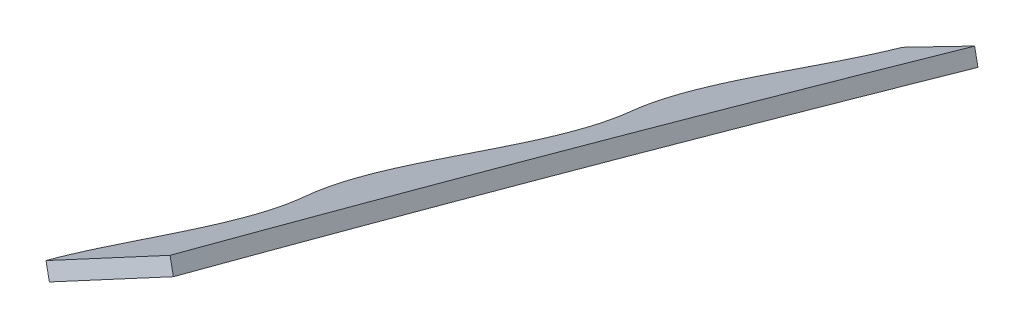
ISO-10303-21;
HEADER;
FILE_DESCRIPTION(('STEP AP214'),'2;1');
FILE_NAME('part.step','',(''),(''),'','','');
FILE_SCHEMA(('AUTOMOTIVE_DESIGN { 1 0 10303 214 1 1 1 1 }'));
ENDSEC;
DATA;
#1=APPLICATION_CONTEXT('core data for automotive mechanical design processes');
#2=APPLICATION_PROTOCOL_DEFINITION('international standard','automotive_design',2000,#1);
#3=PRODUCT_CONTEXT('',#1,'mechanical');
#4=PRODUCT('Part','Part','',(#3));
#5=PRODUCT_RELATED_PRODUCT_CATEGORY('part','',(#4));
#6=PRODUCT_DEFINITION_FORMATION('','',#4);
#7=PRODUCT_DEFINITION_CONTEXT('part definition',#1,'design');
#8=PRODUCT_DEFINITION('design','',#6,#7);
#9=PRODUCT_DEFINITION_SHAPE('','',#8);
#10=(LENGTH_UNIT() NAMED_UNIT(*) SI_UNIT(.MILLI.,.METRE.));
#11=(NAMED_UNIT(*) PLANE_ANGLE_UNIT() SI_UNIT($,.RADIAN.));
#12=(NAMED_UNIT(*) SI_UNIT($,.STERADIAN.) SOLID_ANGLE_UNIT());
#13=UNCERTAINTY_MEASURE_WITH_UNIT(LENGTH_MEASURE(1.E-05),#10,'distance_accuracy_value','');
#14=(GEOMETRIC_REPRESENTATION_CONTEXT(3) GLOBAL_UNCERTAINTY_ASSIGNED_CONTEXT((#13)) GLOBAL_UNIT_ASSIGNED_CONTEXT((#10,
#11,#12)) REPRESENTATION_CONTEXT('',''));
#15=CARTESIAN_POINT('',(0.,0.,0.));
#16=DIRECTION('',(0.,0.,1.));
#17=DIRECTION('',(1.,0.,0.));
#18=AXIS2_PLACEMENT_3D('',#15,#16,#17);
#19=CARTESIAN_POINT('',(-227.216189616129,83.2506448416713,499.552220094288));
#20=DIRECTION('',(-0.445503262094181,0.866025403784441,-0.226995249869768));
#21=DIRECTION('',(0.895192484018144,0.434454822827191,-0.0993952890212628));
#22=AXIS2_PLACEMENT_3D('',#19,#20,#21);
#23=PLANE('',#22);
#24=CARTESIAN_POINT('',(-172.274848039134,-88.2454839224226,-262.563071551798));
#25=CARTESIAN_POINT('',(-172.439831267016,-87.9227909712934,-261.008145359665));
#26=CARTESIAN_POINT('',(-172.678193137253,-87.6388750121653,-259.457146278866));
#27=CARTESIAN_POINT('',(-173.191359809754,-87.2352321682004,-256.910034020532));
#28=CARTESIAN_POINT('',(-173.423681819983,-87.0929392199138,-255.911204654988));
#29=CARTESIAN_POINT('',(-173.941160738584,-86.8421131443134,-253.938651044461));
#30=CARTESIAN_POINT('',(-174.226826981409,-86.7330860021534,-252.962042423846));
#31=CARTESIAN_POINT('',(-175.156975533093,-86.4505188180834,-250.058481340229));
#32=CARTESIAN_POINT('',(-175.87493206562,-86.3216904276833,-248.157910132924));
#33=CARTESIAN_POINT('',(-177.457786989215,-86.1534529403896,-244.40952786397));
#34=CARTESIAN_POINT('',(-178.322613076559,-86.1139998441347,-242.561690841339));
#35=CARTESIAN_POINT('',(-180.140834151136,-86.0889909449713,-238.897817864236));
#36=CARTESIAN_POINT('',(-181.094239221605,-86.1033646810172,-237.081493299449));
#37=CARTESIAN_POINT('',(-183.023234879632,-86.1464324091518,-233.459936848201));
#38=CARTESIAN_POINT('',(-183.998986310508,-86.1750375750492,-231.654050401957));
#39=CARTESIAN_POINT('',(-186.863052794487,-86.2211484455113,-226.208924228764));
#40=CARTESIAN_POINT('',(-188.685373763346,-86.1971861743637,-222.540997819584));
#41=CARTESIAN_POINT('',(-190.924486485076,-85.8506017338599,-216.824213206229));
#42=CARTESIAN_POINT('',(-191.589028343075,-85.6836555687967,-214.88304842063));
#43=CARTESIAN_POINT('',(-192.285870855619,-85.3908765572889,-212.398416365603));
#44=CARTESIAN_POINT('',(-192.418748654995,-85.3280090636639,-211.897778842578));
#45=CARTESIAN_POINT('',(-192.668624175468,-85.1945294250588,-210.898123045647));
#46=CARTESIAN_POINT('',(-192.785847828449,-85.123844932821,-210.398385338385));
#47=CARTESIAN_POINT('',(-193.114191540953,-84.899862874531,-208.899444952298));
#48=CARTESIAN_POINT('',(-193.30194773462,-84.7346180012592,-207.900515437317));
#49=CARTESIAN_POINT('',(-193.771813950714,-84.1911213049337,-204.904818926934));
#50=CARTESIAN_POINT('',(-193.960185118495,-83.764935338542,-202.909147900238));
#51=CARTESIAN_POINT('',(-194.064058276873,-83.03428504667,-199.917730479237));
#52=CARTESIAN_POINT('',(-194.068999796638,-82.7755563686706,-198.920938382749));
#53=CARTESIAN_POINT('',(-194.033602635075,-82.3655723876837,-197.426250754137));
#54=CARTESIAN_POINT('',(-194.01467181003,-82.2252641701454,-196.928104927292));
#55=CARTESIAN_POINT('',(-193.962862535708,-81.9375155013571,-195.931976345358));
#56=CARTESIAN_POINT('',(-193.929915849075,-81.7898775019719,-195.433373833957));
#57=CARTESIAN_POINT('',(-193.732653401734,-81.0394192007136,-192.957397398705));
#58=CARTESIAN_POINT('',(-193.470879681609,-80.396792013461,-191.019425466124));
#59=CARTESIAN_POINT('',(-192.780502657605,-79.0437225735269,-187.21217711051));
#60=CARTESIAN_POINT('',(-192.35181751995,-78.3332470559846,-185.342934384217));
#61=CARTESIAN_POINT('',(-190.862138665294,-76.1190489905928,-179.81905234203));
#62=CARTESIAN_POINT('',(-189.60002053076,-74.5335707659178,-176.247230138271));
#63=CARTESIAN_POINT('',(-188.152743373769,-72.8728266864691,-172.751650967128));
#64=B_SPLINE_CURVE_WITH_KNOTS('',3,(#24,#25,#26,#27,#28,#29,#30,#31,#32,#33,#34,#35,#36,#37,#38,
#39,#40,#41,#42,#43,#44,#45,#46,#47,#48,#49,#50,#51,#52,#53,#54,#55,#56,#57,#58,#59,#60,#61,#62,
#63),.UNSPECIFIED.,.F.,.F.,(4,2,2,2,2,2,2,2,2,2,2,2,2,2,2,2,2,2,2,4),(0.,0.0483442702171738,
0.0795942702171737,0.110844270217174,0.173344270217174,0.235844270217173,0.298344270217173,
0.360844270217173,0.485844270217173,0.548344270217173,0.563969270217173,0.579594270217173,
0.610844270217173,0.673344270217173,0.704594270217173,0.720219270217173,0.735844270217174,
0.798344270217174,0.860844270217174,0.985844270217174),.UNSPECIFIED.);
#65=CARTESIAN_POINT('',(-188.152743373769,-72.872826686469,-172.751650967128));
#66=VERTEX_POINT('',#65);
#67=CARTESIAN_POINT('',(-172.274848039781,-88.2454839227551,-262.563071551798));
#68=VERTEX_POINT('',#67);
#69=EDGE_CURVE('E63',#66,#68,#64,.F.);
#70=ORIENTED_EDGE('',*,*,#69,.T.);
#71=DIRECTION('',(0.889488775164077,0.456950848957748,-0.00237497240046185));
#72=VECTOR('',#71,1.);
#73=CARTESIAN_POINT('',(-147.648824523097,-75.5945290522712,-262.628824069218));
#74=LINE('',#73,#72);
#75=CARTESIAN_POINT('',(-144.201526122531,-73.8235725492409,-262.638028500782));
#76=VERTEX_POINT('',#75);
#77=EDGE_CURVE('E56',#68,#76,#74,.T.);
#78=ORIENTED_EDGE('',*,*,#77,.T.);
#79=CARTESIAN_POINT('',(-16.9046491299026,65.2692204150697,18.1903953203248));
#80=DIRECTION('',(0.445503262094181,-0.866025403784441,0.226995249869768));
#81=DIRECTION('',(0.0125403357558737,-0.247485367087003,-0.968810473238673));
#82=AXIS2_PLACEMENT_3D('',#79,#80,#81);
#83=ELLIPSE('',#82,713.671321725642,162.);
#84=CARTESIAN_POINT('',(-161.908015732658,-5.45842848385961,32.9375415344721));
#85=VERTEX_POINT('',#84);
#86=EDGE_CURVE('E114',#85,#76,#83,.T.);
#87=ORIENTED_EDGE('',*,*,#86,.F.);
#88=DIRECTION('',(-0.895192484018144,-0.434454822827191,0.0993952890212628));
#89=VECTOR('',#88,1.);
#90=CARTESIAN_POINT('',(-221.261607168342,-34.2639139092991,39.5277078735809));
#91=LINE('',#90,#89);
#92=CARTESIAN_POINT('',(-205.375560012895,-26.5540973887618,37.7638433677781));
#93=VERTEX_POINT('',#92);
#94=EDGE_CURVE('E176',#85,#93,#91,.T.);
#95=ORIENTED_EDGE('',*,*,#94,.T.);
#96=CARTESIAN_POINT('',(-205.20029301773,-27.6046990690454,33.4116388038746));
#97=CARTESIAN_POINT('',(-205.32125225234,-27.2880072514378,34.8572677014228));
#98=CARTESIAN_POINT('',(-205.379654706957,-26.9377960407233,36.3080041789655));
#99=CARTESIAN_POINT('',(-205.375560012895,-26.5540973887618,37.7638433677781));
#100=B_SPLINE_CURVE_WITH_KNOTS('',3,(#96,#97,#98,#99),.UNSPECIFIED.,.F.,.F.,(4,4),(0.,
0.0465437655749937),.UNSPECIFIED.);
#101=CARTESIAN_POINT('',(-205.200320367493,-27.6047129416401,33.4116395545035));
#102=VERTEX_POINT('',#101);
#103=EDGE_CURVE('E254',#93,#102,#100,.F.);
#104=ORIENTED_EDGE('',*,*,#103,.T.);
#105=CARTESIAN_POINT('',(-190.734375132116,-31.1238615505722,-8.40552574790049));
#106=CARTESIAN_POINT('',(-191.225622990637,-30.9066511376412,-6.61270294977395));
#107=CARTESIAN_POINT('',(-191.796402656058,-30.7371869636366,-4.84595019687956));
#108=CARTESIAN_POINT('',(-193.055664840276,-30.4689205152964,-1.35102697447093));
#109=CARTESIAN_POINT('',(-193.744068379148,-30.3700708260398,0.377169384185305));
#110=CARTESIAN_POINT('',(-195.910563886591,-30.1343272747744,5.52855788558893));
#111=CARTESIAN_POINT('',(-197.490234729324,-30.0584154196475,8.91845308781303));
#112=CARTESIAN_POINT('',(-199.724102363284,-29.8631181473629,14.0477574136626));
#113=CARTESIAN_POINT('',(-200.44585020281,-29.7842864233443,15.7650237122564));
#114=CARTESIAN_POINT('',(-201.453910991316,-29.6212767972674,18.3653637953677));
#115=CARTESIAN_POINT('',(-201.777543457747,-29.5595033477964,19.2362044678018));
#116=CARTESIAN_POINT('',(-202.393937467392,-29.4174233545711,20.9880051145696));
#117=CARTESIAN_POINT('',(-202.68685951747,-29.3370068809551,21.8696995024388));
#118=CARTESIAN_POINT('',(-203.506023134402,-29.0649076428021,24.5155033968704));
#119=CARTESIAN_POINT('',(-203.973922297989,-28.8417561324266,26.2851680961004));
#120=CARTESIAN_POINT('',(-204.726824659675,-28.2978149061482,29.8380502764758));
#121=CARTESIAN_POINT('',(-205.011950457218,-27.977090639419,31.6212586728743));
#122=CARTESIAN_POINT('',(-205.200293018085,-27.6046990681162,33.411638808115));
#123=B_SPLINE_CURVE_WITH_KNOTS('',3,(#105,#106,#107,#108,#109,#110,#111,#112,#113,#114,#115,
#116,#117,#118,#119,#120,#121,#122),.UNSPECIFIED.,.F.,.F.,(4,2,2,2,2,2,2,2,4),(0.,
0.124999999999998,0.249999999999996,0.499999999999996,0.624999999999996,0.687499999999996,
0.749999999999995,0.874999999999998,1.),.UNSPECIFIED.);
#124=CARTESIAN_POINT('',(-190.734413653469,-31.1238838328777,-8.40553515626446));
#125=VERTEX_POINT('',#124);
#126=EDGE_CURVE('E116',#125,#102,#123,.T.);
#127=ORIENTED_EDGE('',*,*,#126,.F.);
#128=CARTESIAN_POINT('',(-194.917793217108,-44.9118654147233,-52.7986803008964));
#129=CARTESIAN_POINT('',(-193.434700514925,-43.2514696172647,-49.3747218499109));
#130=CARTESIAN_POINT('',(-192.118155072448,-41.6566744340345,-45.8741734743483));
#131=CARTESIAN_POINT('',(-190.505014830945,-39.4069414864574,-40.4570264405086));
#132=CARTESIAN_POINT('',(-190.028134982414,-38.6809919864359,-38.6233352906957));
#133=CARTESIAN_POINT('',(-189.42491286372,-37.6362214197215,-35.8212483279959));
#134=CARTESIAN_POINT('',(-189.242580001583,-37.295346449345,-34.8786008535911));
#135=CARTESIAN_POINT('',(-188.919667300953,-36.6300424351216,-32.9741049828491));
#136=CARTESIAN_POINT('',(-188.778841607756,-36.3048121603044,-32.0096822714008));
#137=CARTESIAN_POINT('',(-188.196150384483,-34.7390348909816,-27.1795721621842));
#138=CARTESIAN_POINT('',(-188.116780347809,-33.6748188910697,-23.2751799720615));
#139=CARTESIAN_POINT('',(-188.603662119147,-32.63004125871,-18.3336167060528));
#140=CARTESIAN_POINT('',(-188.730106041869,-32.4352448337562,-17.3422751130023));
#141=CARTESIAN_POINT('',(-189.042135826204,-32.0744606101394,-15.353429135001));
#142=CARTESIAN_POINT('',(-189.228550202712,-31.9081162757134,-14.3529384535694));
#143=CARTESIAN_POINT('',(-189.800929694284,-31.503914169146,-11.6874808127205));
#144=CARTESIAN_POINT('',(-190.236653704218,-31.2952014747907,-10.0360499417346));
#145=CARTESIAN_POINT('',(-190.734375137028,-31.123861548881,-8.40552573180539));
#146=B_SPLINE_CURVE_WITH_KNOTS('',3,(#128,#129,#130,#131,#132,#133,#134,#135,#136,#137,#138,
#139,#140,#141,#142,#143,#144,#145),.UNSPECIFIED.,.F.,.F.,(4,2,2,2,2,2,2,2,4),
(0.509487641144019,0.63448764114402,0.69698764114402,0.72823764114402,0.75948764114402,
0.884487641144023,0.915737641144023,0.946987641144024,1.),.UNSPECIFIED.);
#147=CARTESIAN_POINT('',(-194.917793217108,-44.9118654147233,-52.7986803008965));
#148=VERTEX_POINT('',#147);
#149=EDGE_CURVE('E243',#125,#148,#146,.F.);
#150=ORIENTED_EDGE('',*,*,#149,.T.);
#151=CARTESIAN_POINT('',(-188.152743373769,-72.8728266864691,-172.751650967128));
#152=CARTESIAN_POINT('',(-187.191666095736,-71.7699947985514,-170.430380505061));
#153=CARTESIAN_POINT('',(-186.311195873677,-70.6990462361812,-168.07255008631));
#154=CARTESIAN_POINT('',(-184.755750725375,-68.6384307478407,-163.263685260357));
#155=CARTESIAN_POINT('',(-184.080506750109,-67.6486574021852,-160.812772882431));
#156=CARTESIAN_POINT('',(-183.268941129832,-66.2436197477622,-157.045102980715));
#157=CARTESIAN_POINT('',(-183.032143647382,-65.7886132130075,-155.773917053856));
#158=CARTESIAN_POINT('',(-182.636463630012,-64.9094186321168,-153.196206270159));
#159=CARTESIAN_POINT('',(-182.479534623727,-64.4893931429288,-151.901728258723));
#160=CARTESIAN_POINT('',(-182.142921645764,-63.2944587278052,-148.003490828137));
#161=CARTESIAN_POINT('',(-182.097552745409,-62.5843642033246,-145.383401180781));
#162=CARTESIAN_POINT('',(-182.339740157099,-61.6691591898698,-141.416419167786));
#163=CARTESIAN_POINT('',(-182.472127775315,-61.3890569651287,-140.087956311267));
#164=CARTESIAN_POINT('',(-182.751863176213,-61.0081246666978,-138.085623304532));
#165=CARTESIAN_POINT('',(-182.858837048299,-60.8874731558236,-137.415369268457));
#166=CARTESIAN_POINT('',(-183.099163398274,-60.6602919508592,-136.076967395214));
#167=CARTESIAN_POINT('',(-183.231849816358,-60.5543123580425,-135.412225503741));
#168=CARTESIAN_POINT('',(-183.954801630447,-60.0605875472435,-132.109708730486));
#169=CARTESIAN_POINT('',(-184.725108012858,-59.782262363449,-129.536039518508));
#170=CARTESIAN_POINT('',(-186.546516249569,-59.3962656383843,-124.488681561013));
#171=CARTESIAN_POINT('',(-187.597333004467,-59.2884208277555,-122.014891302567));
#172=CARTESIAN_POINT('',(-189.841863559447,-59.1595769846803,-117.118190926786));
#173=CARTESIAN_POINT('',(-191.034958852787,-59.1382020543337,-114.695060582993));
#174=CARTESIAN_POINT('',(-193.404969596004,-59.08561888257,-109.843038875524));
#175=CARTESIAN_POINT('',(-194.581438432567,-59.0539096326902,-107.413112607515));
#176=CARTESIAN_POINT('',(-196.757701726525,-58.8844606846457,-102.495478908459));
#177=CARTESIAN_POINT('',(-197.756660414285,-58.7463152508646,-100.007863817439));
#178=CARTESIAN_POINT('',(-199.021077359198,-58.3989017857573,-96.2008645057731));
#179=CARTESIAN_POINT('',(-199.403812816628,-58.2598911581498,-94.9193547390496));
#180=CARTESIAN_POINT('',(-199.91000006403,-58.0106887276697,-92.9751567627387));
#181=CARTESIAN_POINT('',(-200.067710447012,-57.9206312140125,-92.3220480091496));
#182=CARTESIAN_POINT('',(-200.35703435199,-57.7276962978172,-91.0181384236328));
#183=CARTESIAN_POINT('',(-200.488855028922,-57.6247753525024,-90.3667649041719));
#184=CARTESIAN_POINT('',(-201.083239673089,-57.0776456978103,-87.1128268659695));
#185=CARTESIAN_POINT('',(-201.349918127562,-56.5349931347092,-84.5191293026503));
#186=CARTESIAN_POINT('',(-201.45188426188,-55.5712260667239,-80.642074561757));
#187=CARTESIAN_POINT('',(-201.436543703862,-55.2251795528048,-79.3519559206241));
#188=CARTESIAN_POINT('',(-201.34350459119,-54.6709165038379,-77.4199478594943));
#189=CARTESIAN_POINT('',(-201.30082902983,-54.4803010582231,-76.7764730883606));
#190=CARTESIAN_POINT('',(-201.192891196513,-54.08771903233,-75.4905459563432));
#191=CARTESIAN_POINT('',(-201.127584864985,-53.8857756315981,-74.8482685011413));
#192=CARTESIAN_POINT('',(-200.750365351014,-52.8577234193206,-71.6664098117457));
#193=CARTESIAN_POINT('',(-200.285868392247,-51.9702418098417,-69.192143459658));
#194=CARTESIAN_POINT('',(-199.111777175974,-50.0973130243108,-64.3508860257096));
#195=CARTESIAN_POINT('',(-198.401888291576,-49.1117480856785,-61.9840238974504));
#196=CARTESIAN_POINT('',(-196.792486068176,-47.0648251775353,-57.3332953112808));
#197=CARTESIAN_POINT('',(-195.892750445835,-46.003378361214,-55.0495261433257));
#198=CARTESIAN_POINT('',(-194.917793217108,-44.9118654147233,-52.7986803008964));
#199=B_SPLINE_CURVE_WITH_KNOTS('',3,(#151,#152,#153,#154,#155,#156,#157,#158,#159,#160,#161,
#162,#163,#164,#165,#166,#167,#168,#169,#170,#171,#172,#173,#174,#175,#176,#177,#178,#179,#180,
#181,#182,#183,#184,#185,#186,#187,#188,#189,#190,#191,#192,#193,#194,#195,#196,#197,#198),
.UNSPECIFIED.,.F.,.F.,(4,2,2,2,2,2,2,2,2,2,2,2,2,2,2,2,2,2,2,2,2,2,2,4),(0.,0.0624999999999997,
0.124999999999999,0.156249999999999,0.187499999999999,0.249999999999999,0.281249999999999,
0.296874999999999,0.312499999999999,0.375,0.4375,0.500000000000001,0.562500000000001,
0.625000000000002,0.656250000000002,0.671875000000002,0.687500000000002,0.750000000000002,
0.781250000000002,0.796875000000002,0.812500000000002,0.875000000000001,0.937500000000001,1.),.UNSPECIFIED.);
#200=EDGE_CURVE('E285',#148,#66,#199,.F.);
#201=ORIENTED_EDGE('',*,*,#200,.T.);
#202=EDGE_LOOP('',(#70,#78,#87,#95,#104,#127,#150,#201));
#203=FACE_BOUND('',#202,.T.);
#204=ADVANCED_FACE('F38',(#203),#23,.F.);
#205=CARTESIAN_POINT('',(-21.3421443728784,73.5833717242342,14.5655831290799));
#206=DIRECTION('',(-0.0125403357558737,0.247485367087003,0.968810473238673));
#207=DIRECTION('',(0.799290451443861,-0.579685461070446,0.158428344857267));
#208=AXIS2_PLACEMENT_3D('',#205,#206,#207);
#209=PLANE('',#208);
#210=ORIENTED_EDGE('',*,*,#94,.F.);
#211=DIRECTION('',(-0.445503262094181,0.866025403784441,-0.226995249869768));
#212=VECTOR('',#211,1.);
#213=CARTESIAN_POINT('',(-160.126002684281,-8.92253009899742,33.8455225339512));
#214=LINE('',#213,#212);
#215=CARTESIAN_POINT('',(-164.581035305223,-0.262276061153019,31.5755700352536));
#216=VERTEX_POINT('',#215);
#217=EDGE_CURVE('E117',#85,#216,#214,.T.);
#218=ORIENTED_EDGE('',*,*,#217,.T.);
#219=DIRECTION('',(0.895192484018144,0.434454822827191,-0.0993952890212628));
#220=VECTOR('',#219,1.);
#221=CARTESIAN_POINT('',(-223.934626740907,-29.0677614865924,38.1657363743624));
#222=LINE('',#221,#220);
#223=CARTESIAN_POINT('',(-208.04857958546,-21.357944966055,36.4018718685596));
#224=VERTEX_POINT('',#223);
#225=EDGE_CURVE('E128',#224,#216,#222,.T.);
#226=ORIENTED_EDGE('',*,*,#225,.F.);
#227=DIRECTION('',(0.445503262094181,-0.866025403784442,0.226995249869768));
#228=VECTOR('',#227,1.);
#229=CARTESIAN_POINT('',(-209.830592633837,-17.8938433509174,35.4938908690804));
#230=LINE('',#229,#228);
#231=EDGE_CURVE('E234',#224,#93,#230,.T.);
#232=ORIENTED_EDGE('',*,*,#231,.T.);
#233=EDGE_LOOP('',(#210,#218,#226,#232));
#234=FACE_BOUND('',#233,.T.);
#235=ADVANCED_FACE('F199',(#234),#209,.T.);
#236=CARTESIAN_POINT('',(-209.830592633837,-17.8938433509174,35.4938908690804));
#237=CARTESIAN_POINT('',(-209.836091079777,-18.4090824049848,33.5389577394397));
#238=CARTESIAN_POINT('',(-209.728896456917,-18.8639378639572,31.5932256726373));
#239=CARTESIAN_POINT('',(-209.288832298403,-19.6527268591763,27.7201872423698));
#240=CARTESIAN_POINT('',(-208.955749252219,-19.9865459914623,25.7928983114208));
#241=CARTESIAN_POINT('',(-208.078762798725,-20.5412217512445,21.9555333217173));
#242=CARTESIAN_POINT('',(-207.534698104811,-20.7619919575882,20.0454704315469));
#243=CARTESIAN_POINT('',(-206.58776777526,-21.0230437158145,17.1910582555702));
#244=CARTESIAN_POINT('',(-206.251000102283,-21.0983052415131,16.2429789887782));
#245=CARTESIAN_POINT('',(-205.54557870773,-21.22880286621,14.3606409628035));
#246=CARTESIAN_POINT('',(-205.176479798686,-21.2841726736712,13.4249983535412));
#247=CARTESIAN_POINT('',(-203.268835411631,-21.5235570626067,8.7677433667388));
#248=CARTESIAN_POINT('',(-201.541916335718,-21.5940178457307,5.10965400000474));
#249=CARTESIAN_POINT('',(-199.07152196916,-21.7720369218645,-0.417940925311666));
#250=CARTESIAN_POINT('',(-198.268482209278,-21.8436890592143,-2.26736025915153));
#251=CARTESIAN_POINT('',(-196.770130224188,-22.0519327462596,-6.00252661513523));
#252=CARTESIAN_POINT('',(-196.074966612645,-22.1886138820028,-7.88832375251536));
#253=CARTESIAN_POINT('',(-194.850071842375,-22.5617007624417,-11.7157048657978));
#254=CARTESIAN_POINT('',(-194.320410204983,-22.7981484154081,-13.6573122855613));
#255=CARTESIAN_POINT('',(-193.683582823654,-23.247862237869,-16.6228909522671));
#256=CARTESIAN_POINT('',(-193.497168447146,-23.414206572295,-17.6233816336986));
#257=CARTESIAN_POINT('',(-193.185138662811,-23.7749907959118,-19.6122276117));
#258=CARTESIAN_POINT('',(-193.058694740089,-23.9697872208656,-20.6035692047505));
#259=CARTESIAN_POINT('',(-192.57181296875,-25.0145648532253,-25.5451324707591));
#260=CARTESIAN_POINT('',(-192.651183005425,-26.0787808531372,-29.4495246608819));
#261=CARTESIAN_POINT('',(-193.233874228698,-27.6445581224601,-34.2796347700984));
#262=CARTESIAN_POINT('',(-193.374699921895,-27.9697883972772,-35.2440574815467));
#263=CARTESIAN_POINT('',(-193.697612622525,-28.6350924115006,-37.1485533522887));
#264=CARTESIAN_POINT('',(-193.879945484661,-28.9759673818772,-38.0912008266936));
#265=CARTESIAN_POINT('',(-194.483167603356,-30.0207379485915,-40.8932877893933));
#266=CARTESIAN_POINT('',(-194.960047451887,-30.746687448613,-42.7269789392063));
#267=CARTESIAN_POINT('',(-196.57318769339,-32.9964203961902,-48.144125973046));
#268=CARTESIAN_POINT('',(-197.889733135867,-34.5912155794203,-51.6446743486086));
#269=CARTESIAN_POINT('',(-199.37282583805,-36.2516113768789,-55.0686327995941));
#270=B_SPLINE_CURVE_WITH_KNOTS('',3,(#236,#237,#238,#239,#240,#241,#242,#243,#244,#245,#246,
#247,#248,#249,#250,#251,#252,#253,#254,#255,#256,#257,#258,#259,#260,#261,#262,#263,#264,#265,
#266,#267,#268,#269),.UNSPECIFIED.,.F.,.F.,(4,2,2,2,2,2,2,2,2,2,2,2,2,2,2,2,4),(0.,
0.0624999999999982,0.124999999999996,0.187499999999995,0.218749999999994,0.249999999999993,
0.374999999999993,0.437499999999994,0.499999999999995,0.562499999999995,0.593749999999996,
0.624999999999996,0.749999999999998,0.781249999999999,0.812499999999999,0.874999999999999,1.),.UNSPECIFIED.);
#271=DIRECTION('',(0.445503262094181,-0.866025403784442,0.226995249869768));
#272=VECTOR('',#271,1.);
#273=SURFACE_OF_LINEAR_EXTRUSION('',#270,#272);
#274=CARTESIAN_POINT('',(-208.04857958546,-21.3579449660549,36.4018718685595));
#275=CARTESIAN_POINT('',(-208.0540780314,-21.8731840201223,34.4469387389188));
#276=CARTESIAN_POINT('',(-207.94688340854,-22.3280394790948,32.5012066721164));
#277=CARTESIAN_POINT('',(-207.506819250026,-23.1168284743139,28.6281682418488));
#278=CARTESIAN_POINT('',(-207.173736203843,-23.4506476065999,26.7008793108998));
#279=CARTESIAN_POINT('',(-206.296749750348,-24.005323366382,22.8635143211962));
#280=CARTESIAN_POINT('',(-205.752685056434,-24.2260935727257,20.9534514310259));
#281=CARTESIAN_POINT('',(-204.805754726884,-24.487145330952,18.0990392550492));
#282=CARTESIAN_POINT('',(-204.468987053907,-24.5624068566507,17.1509599882572));
#283=CARTESIAN_POINT('',(-203.763565659353,-24.6929044813475,15.2686219622825));
#284=CARTESIAN_POINT('',(-203.39446675031,-24.7482742888087,14.3329793530202));
#285=CARTESIAN_POINT('',(-201.486822363255,-24.9876586777442,9.67572436621777));
#286=CARTESIAN_POINT('',(-199.759903287341,-25.0581194608682,6.01763499948371));
#287=CARTESIAN_POINT('',(-197.289508920783,-25.236138537002,0.490040074167308));
#288=CARTESIAN_POINT('',(-196.486469160901,-25.3077906743518,-1.35937925967256));
#289=CARTESIAN_POINT('',(-194.988117175812,-25.5160343613971,-5.0945456156562));
#290=CARTESIAN_POINT('',(-194.292953564269,-25.6527154971403,-6.98034275303633));
#291=CARTESIAN_POINT('',(-193.068058793999,-26.0258023775793,-10.8077238663188));
#292=CARTESIAN_POINT('',(-192.538397156607,-26.2622500305456,-12.7493312860824));
#293=CARTESIAN_POINT('',(-191.901569775277,-26.7119638530065,-15.7149099527881));
#294=CARTESIAN_POINT('',(-191.71515539877,-26.8783081874325,-16.7154006342197));
#295=CARTESIAN_POINT('',(-191.403125614434,-27.2390924110494,-18.704246612221));
#296=CARTESIAN_POINT('',(-191.276681691712,-27.4338888360031,-19.6955882052715));
#297=CARTESIAN_POINT('',(-190.789799920374,-28.4786664683628,-24.6371514712801));
#298=CARTESIAN_POINT('',(-190.869169957048,-29.5428824682748,-28.5415436614029));
#299=CARTESIAN_POINT('',(-191.451861180321,-31.1086597375976,-33.3716537706193));
#300=CARTESIAN_POINT('',(-191.592686873519,-31.4338900124147,-34.3360764820677));
#301=CARTESIAN_POINT('',(-191.915599574149,-32.0991940266382,-36.2405723528097));
#302=CARTESIAN_POINT('',(-192.097932436285,-32.4400689970147,-37.1832198272146));
#303=CARTESIAN_POINT('',(-192.70115455498,-33.4848395637291,-39.9853067899143));
#304=CARTESIAN_POINT('',(-193.17803440351,-34.2107890637506,-41.8189979397273));
#305=CARTESIAN_POINT('',(-194.791174645014,-36.4605220113277,-47.236144973567));
#306=CARTESIAN_POINT('',(-196.10772008749,-38.0553171945579,-50.7366933491297));
#307=CARTESIAN_POINT('',(-197.590812789674,-39.7157129920165,-54.1606518001151));
#308=B_SPLINE_CURVE_WITH_KNOTS('',3,(#274,#275,#276,#277,#278,#279,#280,#281,#282,#283,#284,
#285,#286,#287,#288,#289,#290,#291,#292,#293,#294,#295,#296,#297,#298,#299,#300,#301,#302,#303,
#304,#305,#306,#307),.UNSPECIFIED.,.F.,.F.,(4,2,2,2,2,2,2,2,2,2,2,2,2,2,2,2,4),(0.,
0.0624999999999982,0.124999999999996,0.187499999999995,0.218749999999994,0.249999999999993,
0.374999999999993,0.437499999999994,0.499999999999995,0.562499999999995,0.593749999999996,
0.624999999999996,0.749999999999998,0.781249999999999,0.812499999999999,0.874999999999999,1.),.UNSPECIFIED.);
#309=CARTESIAN_POINT('',(-207.873312590651,-22.4085466454084,32.0496673089029));
#310=VERTEX_POINT('',#309);
#311=EDGE_CURVE('E152',#310,#224,#308,.F.);
#312=ORIENTED_EDGE('',*,*,#311,.F.);
#313=DIRECTION('',(-0.445503262094181,0.866025403784441,-0.226995249869768));
#314=VECTOR('',#313,1.);
#315=CARTESIAN_POINT('',(-203.418279969709,-31.0688006832528,34.3196198076005));
#316=LINE('',#315,#314);
#317=EDGE_CURVE('E130',#102,#310,#316,.T.);
#318=ORIENTED_EDGE('',*,*,#317,.F.);
#319=ORIENTED_EDGE('',*,*,#103,.F.);
#320=ORIENTED_EDGE('',*,*,#231,.F.);
#321=EDGE_LOOP('',(#312,#318,#319,#320));
#322=FACE_BOUND('',#321,.T.);
#323=ADVANCED_FACE('F187',(#322),#273,.T.);
#324=ORIENTED_EDGE('',*,*,#149,.F.);
#325=DIRECTION('',(-0.445503262094181,0.866025403784441,-0.226995249869768));
#326=VECTOR('',#325,1.);
#327=CARTESIAN_POINT('',(-188.952362083739,-34.58796316571,-7.4975447484214));
#328=LINE('',#327,#326);
#329=CARTESIAN_POINT('',(-193.407394704687,-25.927709127852,-9.76749724712261));
#330=VERTEX_POINT('',#329);
#331=EDGE_CURVE('E49',#125,#330,#328,.T.);
#332=ORIENTED_EDGE('',*,*,#331,.T.);
#333=CARTESIAN_POINT('',(-197.590812789674,-39.7157129920164,-54.1606518001151));
#334=VERTEX_POINT('',#333);
#335=EDGE_CURVE('E157',#334,#330,#308,.F.);
#336=ORIENTED_EDGE('',*,*,#335,.F.);
#337=DIRECTION('',(0.445503262094181,-0.866025403784442,0.226995249869768));
#338=VECTOR('',#337,1.);
#339=CARTESIAN_POINT('',(-199.37282583805,-36.2516113768789,-55.0686327995941));
#340=LINE('',#339,#338);
#341=EDGE_CURVE('E229',#334,#148,#340,.T.);
#342=ORIENTED_EDGE('',*,*,#341,.T.);
#343=EDGE_LOOP('',(#324,#332,#336,#342));
#344=FACE_BOUND('',#343,.T.);
#345=ADVANCED_FACE('F198',(#344),#273,.T.);
#346=CARTESIAN_POINT('',(-229.889209188694,88.446797264378,498.19024859507));
#347=DIRECTION('',(-0.445503262094181,0.866025403784442,-0.226995249869768));
#348=DIRECTION('',(0.895192484018144,0.434454822827191,-0.0993952890212628));
#349=AXIS2_PLACEMENT_3D('',#346,#347,#348);
#350=PLANE('',#349);
#351=DIRECTION('',(0.889488775164078,0.456950848957748,-0.00237497240046179));
#352=VECTOR('',#351,1.);
#353=CARTESIAN_POINT('',(-13.00275474783,0.145598974873887,-264.357443306288));
#354=LINE('',#353,#352);
#355=CARTESIAN_POINT('',(-174.947867611699,-83.0493314997158,-263.925043051017));
#356=VERTEX_POINT('',#355);
#357=CARTESIAN_POINT('',(-146.874545695096,-68.6274201265344,-264.));
#358=VERTEX_POINT('',#357);
#359=EDGE_CURVE('E120',#356,#358,#354,.T.);
#360=ORIENTED_EDGE('',*,*,#359,.F.);
#361=CARTESIAN_POINT('',(-190.825762946334,-67.6766742637622,-174.113622466347));
#362=CARTESIAN_POINT('',(-192.273040103325,-69.3374183432109,-177.609201637489));
#363=CARTESIAN_POINT('',(-193.535158237859,-70.9228965678859,-181.181023841248));
#364=CARTESIAN_POINT('',(-195.024837092515,-73.1370946332777,-186.704905883436));
#365=CARTESIAN_POINT('',(-195.45352223017,-73.8475701508201,-188.574148609729));
#366=CARTESIAN_POINT('',(-196.143899254174,-75.2006395907541,-192.381396965342));
#367=CARTESIAN_POINT('',(-196.405672974299,-75.8432667780067,-194.319368897924));
#368=CARTESIAN_POINT('',(-196.60293542164,-76.593725079265,-196.795345333176));
#369=CARTESIAN_POINT('',(-196.635882108273,-76.7413630786502,-197.293947844577));
#370=CARTESIAN_POINT('',(-196.687691382596,-77.0291117474385,-198.290076426511));
#371=CARTESIAN_POINT('',(-196.70662220764,-77.1694199649767,-198.788222253356));
#372=CARTESIAN_POINT('',(-196.742019369203,-77.5794039459637,-200.282909881967));
#373=CARTESIAN_POINT('',(-196.737077849438,-77.8381326239631,-201.279701978455));
#374=CARTESIAN_POINT('',(-196.63320469106,-78.5687829158351,-204.271119399456));
#375=CARTESIAN_POINT('',(-196.444833523279,-78.9949688822268,-206.266790426153));
#376=CARTESIAN_POINT('',(-195.974967307185,-79.5384655785523,-209.262486936536));
#377=CARTESIAN_POINT('',(-195.787211113518,-79.7037104518241,-210.261416451517));
#378=CARTESIAN_POINT('',(-195.458867401014,-79.9276925101141,-211.760356837603));
#379=CARTESIAN_POINT('',(-195.341643748033,-79.9983770023519,-212.260094544865));
#380=CARTESIAN_POINT('',(-195.09176822756,-80.1318566409571,-213.259750341797));
#381=CARTESIAN_POINT('',(-194.958890428185,-80.194724134582,-213.760387864822));
#382=CARTESIAN_POINT('',(-194.26204791564,-80.4875031460898,-216.245019919849));
#383=CARTESIAN_POINT('',(-193.597506057641,-80.654449311153,-218.186184705448));
#384=CARTESIAN_POINT('',(-191.358393335911,-81.0010337516567,-223.902969318803));
#385=CARTESIAN_POINT('',(-189.536072367052,-81.0249960228044,-227.570895727982));
#386=CARTESIAN_POINT('',(-186.672005883073,-80.9788851523423,-233.016021901176));
#387=CARTESIAN_POINT('',(-185.696254452197,-80.9502799864449,-234.821908347419));
#388=CARTESIAN_POINT('',(-183.767258794171,-80.9072122583103,-238.443464798668));
#389=CARTESIAN_POINT('',(-182.813853723701,-80.8928385222644,-240.259789363455));
#390=CARTESIAN_POINT('',(-180.995632649124,-80.9178474214277,-243.923662340558));
#391=CARTESIAN_POINT('',(-180.13080656178,-80.9573005176827,-245.771499363189));
#392=CARTESIAN_POINT('',(-178.547951638185,-81.1255380049764,-249.519881632142));
#393=CARTESIAN_POINT('',(-177.829995105658,-81.2543663953764,-251.420452839447));
#394=CARTESIAN_POINT('',(-176.899846553974,-81.5369335794465,-254.324013923065));
#395=CARTESIAN_POINT('',(-176.614180311149,-81.6459607216065,-255.30062254368));
#396=CARTESIAN_POINT('',(-176.096701392548,-81.896786797207,-257.273176154206));
#397=CARTESIAN_POINT('',(-175.864379382319,-82.0390797454935,-258.27200551975));
#398=CARTESIAN_POINT('',(-175.259946733892,-82.5145099054593,-261.272118135486));
#399=CARTESIAN_POINT('',(-174.979547875863,-82.8962282718715,-263.278752232916));
#400=CARTESIAN_POINT('',(-174.821816298889,-83.3427702439492,-265.291951293313));
#401=B_SPLINE_CURVE_WITH_KNOTS('',3,(#361,#362,#363,#364,#365,#366,#367,#368,#369,#370,#371,
#372,#373,#374,#375,#376,#377,#378,#379,#380,#381,#382,#383,#384,#385,#386,#387,#388,#389,#390,
#391,#392,#393,#394,#395,#396,#397,#398,#399,#400),.UNSPECIFIED.,.F.,.F.,(4,2,2,2,2,2,2,2,2,2,2,
2,2,2,2,2,2,2,2,4),(0.,0.125,0.1875,0.250000000000001,0.265625000000001,0.281250000000001,
0.312500000000001,0.375000000000001,0.406250000000001,0.421875000000001,0.437500000000001,
0.500000000000001,0.625000000000001,0.687500000000001,0.750000000000001,0.812500000000001,
0.875000000000001,0.906250000000001,0.9375,1.),.UNSPECIFIED.);
#402=CARTESIAN_POINT('',(-190.825762946334,-67.6766742637623,-174.113622466347));
#403=VERTEX_POINT('',#402);
#404=EDGE_CURVE('E156',#356,#403,#401,.F.);
#405=ORIENTED_EDGE('',*,*,#404,.T.);
#406=CARTESIAN_POINT('',(-197.590812789674,-39.7157129920165,-54.1606518001151));
#407=CARTESIAN_POINT('',(-198.5657700184,-40.8072259385072,-56.4114976425445));
#408=CARTESIAN_POINT('',(-199.465505640742,-41.8686727548285,-58.6952668104995));
#409=CARTESIAN_POINT('',(-201.074907864142,-43.9155956629717,-63.3459953966691));
#410=CARTESIAN_POINT('',(-201.784796748539,-44.901160601604,-65.7128575249282));
#411=CARTESIAN_POINT('',(-202.958887964812,-46.7740893871349,-70.5541149588767));
#412=CARTESIAN_POINT('',(-203.423384923579,-47.6615709966138,-73.0283813109643));
#413=CARTESIAN_POINT('',(-203.80060443755,-48.6896232088913,-76.2102400003599));
#414=CARTESIAN_POINT('',(-203.865910769078,-48.8915666096232,-76.8525174555618));
#415=CARTESIAN_POINT('',(-203.973848602395,-49.2841486355163,-78.1384445875793));
#416=CARTESIAN_POINT('',(-204.016524163755,-49.4747640811311,-78.781919358713));
#417=CARTESIAN_POINT('',(-204.109563276428,-50.029027130098,-80.7139274198428));
#418=CARTESIAN_POINT('',(-204.124903834446,-50.375073644017,-82.0040460609756));
#419=CARTESIAN_POINT('',(-204.022937700128,-51.3388407120024,-85.8811008018689));
#420=CARTESIAN_POINT('',(-203.756259245654,-51.8814932751035,-88.4747983651881));
#421=CARTESIAN_POINT('',(-203.161874601487,-52.4286229297956,-91.7287364033905));
#422=CARTESIAN_POINT('',(-203.030053924555,-52.5315438751103,-92.3801099228514));
#423=CARTESIAN_POINT('',(-202.740730019577,-52.7244787913057,-93.6840195083682));
#424=CARTESIAN_POINT('',(-202.583019636596,-52.8145363049629,-94.3371282619574));
#425=CARTESIAN_POINT('',(-202.076832389193,-53.0637387354429,-96.2813262382682));
#426=CARTESIAN_POINT('',(-201.694096931764,-53.2027493630505,-97.5628360049918));
#427=CARTESIAN_POINT('',(-200.42967998685,-53.5501628281578,-101.369835316658));
#428=CARTESIAN_POINT('',(-199.43072129909,-53.6883082619388,-103.857450407678));
#429=CARTESIAN_POINT('',(-197.254458005132,-53.8577572099833,-108.775084106733));
#430=CARTESIAN_POINT('',(-196.077989168569,-53.8894664598631,-111.205010374742));
#431=CARTESIAN_POINT('',(-193.707978425352,-53.942049631627,-116.057032082212));
#432=CARTESIAN_POINT('',(-192.514883132012,-53.9634245619735,-118.480162426005));
#433=CARTESIAN_POINT('',(-190.270352577032,-54.0922684050486,-123.376862801786));
#434=CARTESIAN_POINT('',(-189.219535822134,-54.2001132156775,-125.850653060232));
#435=CARTESIAN_POINT('',(-187.398127585423,-54.5861099407422,-130.898011017726));
#436=CARTESIAN_POINT('',(-186.627821203012,-54.8644351245366,-133.471680229704));
#437=CARTESIAN_POINT('',(-185.904869388923,-55.3581599353356,-136.774197002959));
#438=CARTESIAN_POINT('',(-185.772182970839,-55.4641395281524,-137.438938894433));
#439=CARTESIAN_POINT('',(-185.531856620864,-55.6913207331168,-138.777340767675));
#440=CARTESIAN_POINT('',(-185.424882748778,-55.811972243991,-139.447594803751));
#441=CARTESIAN_POINT('',(-185.14514734788,-56.1929045424219,-141.449927810485));
#442=CARTESIAN_POINT('',(-185.012759729664,-56.4730067671629,-142.778390667004));
#443=CARTESIAN_POINT('',(-184.770572317975,-57.3882117806178,-146.745372679999));
#444=CARTESIAN_POINT('',(-184.81594121833,-58.0983063050983,-149.365462327355));
#445=CARTESIAN_POINT('',(-185.152554196292,-59.2932407202219,-153.263699757942));
#446=CARTESIAN_POINT('',(-185.309483202577,-59.7132662094099,-154.558177769378));
#447=CARTESIAN_POINT('',(-185.705163219947,-60.5924607903006,-157.135888553074));
#448=CARTESIAN_POINT('',(-185.941960702397,-61.0474673250554,-158.407074479933));
#449=CARTESIAN_POINT('',(-186.753526322674,-62.4525049794784,-162.174744381649));
#450=CARTESIAN_POINT('',(-187.42877029794,-63.4422783251339,-164.625656759576));
#451=CARTESIAN_POINT('',(-188.984215446243,-65.5028938134744,-169.434521585528));
#452=CARTESIAN_POINT('',(-189.864685668301,-66.5738423758446,-171.79235200428));
#453=CARTESIAN_POINT('',(-190.825762946334,-67.6766742637623,-174.113622466347));
#454=B_SPLINE_CURVE_WITH_KNOTS('',3,(#406,#407,#408,#409,#410,#411,#412,#413,#414,#415,#416,
#417,#418,#419,#420,#421,#422,#423,#424,#425,#426,#427,#428,#429,#430,#431,#432,#433,#434,#435,
#436,#437,#438,#439,#440,#441,#442,#443,#444,#445,#446,#447,#448,#449,#450,#451,#452,#453),
.UNSPECIFIED.,.F.,.F.,(4,2,2,2,2,2,2,2,2,2,2,2,2,2,2,2,2,2,2,2,2,2,2,4),(0.,0.0624999999999995,
0.124999999999999,0.187499999999998,0.203124999999998,0.218749999999998,0.249999999999998,
0.312499999999998,0.328124999999998,0.343749999999998,0.374999999999998,0.437499999999999,
0.499999999999999,0.5625,0.625,0.687500000000001,0.703125000000001,0.718750000000001,
0.750000000000001,0.812500000000001,0.843750000000001,0.875000000000001,0.9375,1.),.UNSPECIFIED.);
#455=EDGE_CURVE('E164',#403,#334,#454,.F.);
#456=ORIENTED_EDGE('',*,*,#455,.T.);
#457=ORIENTED_EDGE('',*,*,#335,.T.);
#458=CARTESIAN_POINT('',(-207.87331259065,-22.4085466454095,32.0496673088963));
#459=CARTESIAN_POINT('',(-207.684970029783,-22.7809382167124,30.2592871736557));
#460=CARTESIAN_POINT('',(-207.39984423224,-23.1016624834416,28.4760787772571));
#461=CARTESIAN_POINT('',(-206.646941870554,-23.6456037097199,24.9231965968818));
#462=CARTESIAN_POINT('',(-206.179042706967,-23.8687552200954,23.1535318976518));
#463=CARTESIAN_POINT('',(-205.359879090035,-24.1408544582484,20.5077280032202));
#464=CARTESIAN_POINT('',(-205.066957039957,-24.2212709318644,19.626033615351));
#465=CARTESIAN_POINT('',(-204.450563030312,-24.3633509250898,17.8742329685832));
#466=CARTESIAN_POINT('',(-204.126930563881,-24.4251243745608,17.0033922961491));
#467=CARTESIAN_POINT('',(-203.118869775375,-24.5881340006376,14.4030522130377));
#468=CARTESIAN_POINT('',(-202.397121935849,-24.6669657246562,12.685785914444));
#469=CARTESIAN_POINT('',(-200.163254301889,-24.8622629969409,7.55648158859447));
#470=CARTESIAN_POINT('',(-198.583583459156,-24.9381748520678,4.16658638637031));
#471=CARTESIAN_POINT('',(-196.417087951713,-25.1739184033332,-0.98480211503331));
#472=CARTESIAN_POINT('',(-195.728684412841,-25.2727680925897,-2.7129984736896));
#473=CARTESIAN_POINT('',(-194.469422228623,-25.5410345409299,-6.20792169609828));
#474=CARTESIAN_POINT('',(-193.898642563202,-25.7104987149346,-7.97467444899257));
#475=CARTESIAN_POINT('',(-193.407394704681,-25.9277091278655,-9.7674972471191));
#476=B_SPLINE_CURVE_WITH_KNOTS('',3,(#458,#459,#460,#461,#462,#463,#464,#465,#466,#467,#468,
#469,#470,#471,#472,#473,#474,#475),.UNSPECIFIED.,.F.,.F.,(4,2,2,2,2,2,2,2,4),(0.,
0.125000000000002,0.250000000000005,0.312500000000004,0.375000000000004,0.500000000000004,
0.750000000000004,0.875000000000002,1.),.UNSPECIFIED.);
#477=EDGE_CURVE('E151',#310,#330,#476,.T.);
#478=ORIENTED_EDGE('',*,*,#477,.F.);
#479=ORIENTED_EDGE('',*,*,#311,.T.);
#480=ORIENTED_EDGE('',*,*,#225,.T.);
#481=CARTESIAN_POINT('',(-19.5776687024677,70.4653728377763,16.8284238211063));
#482=DIRECTION('',(0.445503262094181,-0.866025403784441,0.226995249869768));
#483=DIRECTION('',(0.0125403357558737,-0.247485367087003,-0.968810473238673));
#484=AXIS2_PLACEMENT_3D('',#481,#482,#483);
#485=ELLIPSE('',#484,713.671321725642,162.);
#486=EDGE_CURVE('E111',#216,#358,#485,.T.);
#487=ORIENTED_EDGE('',*,*,#486,.T.);
#488=EDGE_LOOP('',(#360,#405,#456,#457,#478,#479,#480,#487));
#489=FACE_BOUND('',#488,.T.);
#490=ADVANCED_FACE('F40',(#489),#350,.T.);
#491=CARTESIAN_POINT('',(-192.607775994711,-64.2125726486247,-175.021603465826));
#492=CARTESIAN_POINT('',(-194.055053151702,-65.8733167280733,-178.517182636968));
#493=CARTESIAN_POINT('',(-195.317171286236,-67.4587949527484,-182.089004840727));
#494=CARTESIAN_POINT('',(-196.806850140892,-69.6729930181402,-187.612886882915));
#495=CARTESIAN_POINT('',(-197.235535278547,-70.3834685356825,-189.482129609208));
#496=CARTESIAN_POINT('',(-197.925912302551,-71.7365379756165,-193.289377964821));
#497=CARTESIAN_POINT('',(-198.187686022676,-72.3791651628691,-195.227349897403));
#498=CARTESIAN_POINT('',(-198.384948470017,-73.1296234641274,-197.703326332655));
#499=CARTESIAN_POINT('',(-198.41789515665,-73.2772614635126,-198.201928844056));
#500=CARTESIAN_POINT('',(-198.469704430972,-73.565010132301,-199.19805742599));
#501=CARTESIAN_POINT('',(-198.488635256017,-73.7053183498392,-199.696203252835));
#502=CARTESIAN_POINT('',(-198.52403241758,-74.1153023308262,-201.190890881446));
#503=CARTESIAN_POINT('',(-198.519090897815,-74.3740310088256,-202.187682977934));
#504=CARTESIAN_POINT('',(-198.415217739437,-75.1046813006975,-205.179100398935));
#505=CARTESIAN_POINT('',(-198.226846571656,-75.5308672670892,-207.174771425632));
#506=CARTESIAN_POINT('',(-197.756980355562,-76.0743639634147,-210.170467936015));
#507=CARTESIAN_POINT('',(-197.569224161895,-76.2396088366866,-211.169397450996));
#508=CARTESIAN_POINT('',(-197.240880449391,-76.4635908949765,-212.668337837082));
#509=CARTESIAN_POINT('',(-197.12365679641,-76.5342753872143,-213.168075544344));
#510=CARTESIAN_POINT('',(-196.873781275937,-76.6677550258195,-214.167731341276));
#511=CARTESIAN_POINT('',(-196.740903476561,-76.7306225194444,-214.668368864301));
#512=CARTESIAN_POINT('',(-196.044060964016,-77.0234015309523,-217.153000919327));
#513=CARTESIAN_POINT('',(-195.379519106018,-77.1903476960154,-219.094165704927));
#514=CARTESIAN_POINT('',(-193.140406384288,-77.5369321365192,-224.810950318282));
#515=CARTESIAN_POINT('',(-191.318085415429,-77.5608944076669,-228.478876727461));
#516=CARTESIAN_POINT('',(-188.45401893145,-77.5147835372047,-233.924002900655));
#517=CARTESIAN_POINT('',(-187.478267500574,-77.4861783713073,-235.729889346899));
#518=CARTESIAN_POINT('',(-185.549271842547,-77.4431106431728,-239.351445798147));
#519=CARTESIAN_POINT('',(-184.595866772078,-77.4287369071269,-241.167770362934));
#520=CARTESIAN_POINT('',(-182.777645697501,-77.4537458062902,-244.831643340037));
#521=CARTESIAN_POINT('',(-181.912819610156,-77.4931989025452,-246.679480362668));
#522=CARTESIAN_POINT('',(-180.329964686561,-77.6614363898388,-250.427862631621));
#523=CARTESIAN_POINT('',(-179.612008154035,-77.7902647802389,-252.328433838927));
#524=CARTESIAN_POINT('',(-178.681859602351,-78.072831964309,-255.231994922544));
#525=CARTESIAN_POINT('',(-178.396193359526,-78.1818591064689,-256.208603543159));
#526=CARTESIAN_POINT('',(-177.878714440925,-78.4326851820694,-258.181157153685));
#527=CARTESIAN_POINT('',(-177.646392430696,-78.574978130356,-259.179986519229));
#528=CARTESIAN_POINT('',(-177.041959782268,-79.0504082903217,-262.180099134965));
#529=CARTESIAN_POINT('',(-176.76156092424,-79.4321266567339,-264.186733232395));
#530=CARTESIAN_POINT('',(-176.603829347266,-79.8786686288117,-266.199932292792));
#531=B_SPLINE_CURVE_WITH_KNOTS('',3,(#491,#492,#493,#494,#495,#496,#497,#498,#499,#500,#501,
#502,#503,#504,#505,#506,#507,#508,#509,#510,#511,#512,#513,#514,#515,#516,#517,#518,#519,#520,
#521,#522,#523,#524,#525,#526,#527,#528,#529,#530),.UNSPECIFIED.,.F.,.F.,(4,2,2,2,2,2,2,2,2,2,2,
2,2,2,2,2,2,2,2,4),(0.,0.125,0.1875,0.250000000000001,0.265625000000001,0.281250000000001,
0.312500000000001,0.375000000000001,0.406250000000001,0.421875000000001,0.437500000000001,
0.500000000000001,0.625000000000001,0.687500000000001,0.750000000000001,0.812500000000001,
0.875000000000001,0.906250000000001,0.9375,1.),.UNSPECIFIED.);
#532=DIRECTION('',(0.445503262094181,-0.866025403784442,0.226995249869768));
#533=VECTOR('',#532,1.);
#534=SURFACE_OF_LINEAR_EXTRUSION('',#531,#533);
#535=DIRECTION('',(0.445503262094181,-0.866025403784442,0.226995249869768));
#536=VECTOR('',#535,1.);
#537=CARTESIAN_POINT('',(-173.611357825417,-85.6474077110692,-263.244057301408));
#538=LINE('',#537,#536);
#539=EDGE_CURVE('E11',#68,#356,#538,.F.);
#540=ORIENTED_EDGE('',*,*,#539,.F.);
#541=ORIENTED_EDGE('',*,*,#69,.F.);
#542=DIRECTION('',(0.445503262094181,-0.866025403784442,0.226995249869768));
#543=VECTOR('',#542,1.);
#544=CARTESIAN_POINT('',(-192.607775994711,-64.2125726486247,-175.021603465826));
#545=LINE('',#544,#543);
#546=EDGE_CURVE('E233',#403,#66,#545,.T.);
#547=ORIENTED_EDGE('',*,*,#546,.F.);
#548=ORIENTED_EDGE('',*,*,#404,.F.);
#549=EDGE_LOOP('',(#540,#541,#547,#548));
#550=FACE_BOUND('',#549,.T.);
#551=ADVANCED_FACE('F298',(#550),#534,.T.);
#552=CARTESIAN_POINT('',(-199.37282583805,-36.2516113768789,-55.0686327995941));
#553=CARTESIAN_POINT('',(-200.347783066777,-37.3431243233696,-57.3194786420234));
#554=CARTESIAN_POINT('',(-201.247518689118,-38.4045711396909,-59.6032478099785));
#555=CARTESIAN_POINT('',(-202.856920912518,-40.4514940478341,-64.2539763961481));
#556=CARTESIAN_POINT('',(-203.566809796916,-41.4370589864664,-66.6208385244073));
#557=CARTESIAN_POINT('',(-204.740901013189,-43.3099877719973,-71.4620959583557));
#558=CARTESIAN_POINT('',(-205.205397971956,-44.1974693814762,-73.9363623104434));
#559=CARTESIAN_POINT('',(-205.582617485927,-45.2255215937537,-77.118220999839));
#560=CARTESIAN_POINT('',(-205.647923817455,-45.4274649944856,-77.7604984550409));
#561=CARTESIAN_POINT('',(-205.755861650772,-45.8200470203787,-79.0464255870583));
#562=CARTESIAN_POINT('',(-205.798537212132,-46.0106624659935,-79.689900358192));
#563=CARTESIAN_POINT('',(-205.891576324804,-46.5649255149604,-81.6219084193218));
#564=CARTESIAN_POINT('',(-205.906916882822,-46.9109720288794,-82.9120270604547));
#565=CARTESIAN_POINT('',(-205.804950748504,-47.8747390968648,-86.789081801348));
#566=CARTESIAN_POINT('',(-205.538272294031,-48.4173916599659,-89.3827793646672));
#567=CARTESIAN_POINT('',(-204.943887649863,-48.964521314658,-92.6367174028696));
#568=CARTESIAN_POINT('',(-204.812066972932,-49.0674422599727,-93.2880909223305));
#569=CARTESIAN_POINT('',(-204.522743067954,-49.2603771761681,-94.5920005078473));
#570=CARTESIAN_POINT('',(-204.365032684972,-49.3504346898253,-95.2451092614364));
#571=CARTESIAN_POINT('',(-203.858845437569,-49.5996371203053,-97.1893072377473));
#572=CARTESIAN_POINT('',(-203.47610998014,-49.7386477479129,-98.4708170044708));
#573=CARTESIAN_POINT('',(-202.211693035227,-50.0860612130202,-102.277816316137));
#574=CARTESIAN_POINT('',(-201.212734347466,-50.2242066468013,-104.765431407157));
#575=CARTESIAN_POINT('',(-199.036471053509,-50.3936555948457,-109.683065106212));
#576=CARTESIAN_POINT('',(-197.860002216946,-50.4253648447255,-112.112991374221));
#577=CARTESIAN_POINT('',(-195.489991473728,-50.4779480164893,-116.965013081691));
#578=CARTESIAN_POINT('',(-194.296896180389,-50.4993229468359,-119.388143425484));
#579=CARTESIAN_POINT('',(-192.052365625409,-50.628166789911,-124.284843801265));
#580=CARTESIAN_POINT('',(-191.001548870511,-50.7360116005399,-126.758634059711));
#581=CARTESIAN_POINT('',(-189.180140633799,-51.1220083256046,-131.805992017205));
#582=CARTESIAN_POINT('',(-188.409834251389,-51.400333509399,-134.379661229183));
#583=CARTESIAN_POINT('',(-187.6868824373,-51.894058320198,-137.682178002438));
#584=CARTESIAN_POINT('',(-187.554196019216,-52.0000379130148,-138.346919893912));
#585=CARTESIAN_POINT('',(-187.313869669241,-52.2272191179792,-139.685321767154));
#586=CARTESIAN_POINT('',(-187.206895797154,-52.3478706288534,-140.35557580323));
#587=CARTESIAN_POINT('',(-186.927160396257,-52.7288029272843,-142.357908809964));
#588=CARTESIAN_POINT('',(-186.794772778041,-53.0089051520253,-143.686371666483));
#589=CARTESIAN_POINT('',(-186.552585366351,-53.9241101654802,-147.653353679478));
#590=CARTESIAN_POINT('',(-186.597954266706,-54.6342046899608,-150.273443326834));
#591=CARTESIAN_POINT('',(-186.934567244669,-55.8291391050843,-154.171680757421));
#592=CARTESIAN_POINT('',(-187.091496250953,-56.2491645942724,-155.466158768857));
#593=CARTESIAN_POINT('',(-187.487176268323,-57.1283591751631,-158.043869552553));
#594=CARTESIAN_POINT('',(-187.723973750774,-57.5833657099178,-159.315055479412));
#595=CARTESIAN_POINT('',(-188.535539371051,-58.9884033643408,-163.082725381129));
#596=CARTESIAN_POINT('',(-189.210783346317,-59.9781767099963,-165.533637759055));
#597=CARTESIAN_POINT('',(-190.766228494619,-62.0387921983368,-170.342502585007));
#598=CARTESIAN_POINT('',(-191.646698716678,-63.109740760707,-172.700333003759));
#599=CARTESIAN_POINT('',(-192.607775994711,-64.2125726486247,-175.021603465826));
#600=B_SPLINE_CURVE_WITH_KNOTS('',3,(#552,#553,#554,#555,#556,#557,#558,#559,#560,#561,#562,
#563,#564,#565,#566,#567,#568,#569,#570,#571,#572,#573,#574,#575,#576,#577,#578,#579,#580,#581,
#582,#583,#584,#585,#586,#587,#588,#589,#590,#591,#592,#593,#594,#595,#596,#597,#598,#599),
.UNSPECIFIED.,.F.,.F.,(4,2,2,2,2,2,2,2,2,2,2,2,2,2,2,2,2,2,2,2,2,2,2,4),(0.,0.0624999999999995,
0.124999999999999,0.187499999999998,0.203124999999998,0.218749999999998,0.249999999999998,
0.312499999999998,0.328124999999998,0.343749999999998,0.374999999999998,0.437499999999999,
0.499999999999999,0.5625,0.625,0.687500000000001,0.703125000000001,0.718750000000001,
0.750000000000001,0.812500000000001,0.843750000000001,0.875000000000001,0.9375,1.),.UNSPECIFIED.);
#601=DIRECTION('',(0.445503262094181,-0.866025403784442,0.226995249869768));
#602=VECTOR('',#601,1.);
#603=SURFACE_OF_LINEAR_EXTRUSION('',#600,#602);
#604=ORIENTED_EDGE('',*,*,#546,.T.);
#605=ORIENTED_EDGE('',*,*,#200,.F.);
#606=ORIENTED_EDGE('',*,*,#341,.F.);
#607=ORIENTED_EDGE('',*,*,#455,.F.);
#608=EDGE_LOOP('',(#604,#605,#606,#607));
#609=FACE_BOUND('',#608,.T.);
#610=ADVANCED_FACE('F201',(#609),#603,.T.);
#611=CARTESIAN_POINT('',(-188.952362083739,-34.58796316571,-7.4975447484214));
#612=CARTESIAN_POINT('',(-189.443609942261,-34.3707527527791,-5.70472195029487));
#613=CARTESIAN_POINT('',(-190.014389607681,-34.2012885787744,-3.93796919740058));
#614=CARTESIAN_POINT('',(-191.273651791899,-33.9330221304342,-0.443045974991896));
#615=CARTESIAN_POINT('',(-191.962055330771,-33.8341724411776,1.28515038366439));
#616=CARTESIAN_POINT('',(-194.128550838214,-33.5984288899123,6.43653888506801));
#617=CARTESIAN_POINT('',(-195.708221680947,-33.5225170347853,9.82643408729217));
#618=CARTESIAN_POINT('',(-197.942089314908,-33.3272197625007,14.9557384131417));
#619=CARTESIAN_POINT('',(-198.663837154433,-33.2483880384821,16.6730047117354));
#620=CARTESIAN_POINT('',(-199.671897942939,-33.0853784124053,19.2733447948468));
#621=CARTESIAN_POINT('',(-199.99553040937,-33.0236049629342,20.1441854672809));
#622=CARTESIAN_POINT('',(-200.611924419015,-32.8815249697088,21.8959861140487));
#623=CARTESIAN_POINT('',(-200.904846469093,-32.8011084960929,22.7776805019179));
#624=CARTESIAN_POINT('',(-201.724010086025,-32.5290092579399,25.4234843963495));
#625=CARTESIAN_POINT('',(-202.191909249612,-32.3058577475644,27.1931490955795));
#626=CARTESIAN_POINT('',(-202.944811611298,-31.761916521286,30.7460312759548));
#627=CARTESIAN_POINT('',(-203.229937408842,-31.4411922545569,32.5292396723534));
#628=CARTESIAN_POINT('',(-203.418279969708,-31.068800683254,34.319619807594));
#629=B_SPLINE_CURVE_WITH_KNOTS('',3,(#611,#612,#613,#614,#615,#616,#617,#618,#619,#620,#621,
#622,#623,#624,#625,#626,#627,#628),.UNSPECIFIED.,.F.,.F.,(4,2,2,2,2,2,2,2,4),(0.,
0.124999999999998,0.249999999999996,0.499999999999996,0.624999999999996,0.687499999999996,
0.749999999999995,0.874999999999998,1.),.UNSPECIFIED.);
#630=DIRECTION('',(-0.445503262094181,0.866025403784441,-0.226995249869768));
#631=VECTOR('',#630,1.);
#632=SURFACE_OF_LINEAR_EXTRUSION('',#629,#631);
#633=ORIENTED_EDGE('',*,*,#126,.T.);
#634=ORIENTED_EDGE('',*,*,#317,.T.);
#635=ORIENTED_EDGE('',*,*,#477,.T.);
#636=ORIENTED_EDGE('',*,*,#331,.F.);
#637=EDGE_LOOP('',(#633,#634,#635,#636));
#638=FACE_BOUND('',#637,.T.);
#639=ADVANCED_FACE('F323',(#638),#632,.T.);
#640=CARTESIAN_POINT('',(-15.1226360815259,61.8051187999318,19.098376319804));
#641=DIRECTION('',(0.445503262094181,-0.866025403784441,0.226995249869768));
#642=DIRECTION('',(0.0125403357558737,-0.247485367087003,-0.968810473238673));
#643=AXIS2_PLACEMENT_3D('',#640,#641,#642);
#644=ELLIPSE('',#643,713.671321725642,162.);
#645=DIRECTION('',(-0.445503262094181,0.866025403784441,-0.226995249869768));
#646=VECTOR('',#645,1.);
#647=SURFACE_OF_LINEAR_EXTRUSION('',#644,#646);
#648=ORIENTED_EDGE('',*,*,#86,.T.);
#649=DIRECTION('',(-0.445503262094181,0.866025403784441,-0.226995249869768));
#650=VECTOR('',#649,1.);
#651=CARTESIAN_POINT('',(-142.419513074154,-77.2876741643788,-261.730047501303));
#652=LINE('',#651,#650);
#653=EDGE_CURVE('E107',#76,#358,#652,.T.);
#654=ORIENTED_EDGE('',*,*,#653,.T.);
#655=ORIENTED_EDGE('',*,*,#486,.F.);
#656=ORIENTED_EDGE('',*,*,#217,.F.);
#657=EDGE_LOOP('',(#648,#654,#655,#656));
#658=FACE_BOUND('',#657,.T.);
#659=ADVANCED_FACE('F109',(#658),#647,.T.);
#660=CARTESIAN_POINT('',(-8.5477221268882,-8.51465506297051,-262.08749080759));
#661=DIRECTION('',(-0.10166888570528,0.202967784726513,0.97389296950058));
#662=DIRECTION('',(0.795152702872135,-0.571719520390824,0.20216075068921));
#663=AXIS2_PLACEMENT_3D('',#660,#661,#662);
#664=PLANE('',#663);
#665=ORIENTED_EDGE('',*,*,#539,.T.);
#666=ORIENTED_EDGE('',*,*,#359,.T.);
#667=ORIENTED_EDGE('',*,*,#653,.F.);
#668=ORIENTED_EDGE('',*,*,#77,.F.);
#669=EDGE_LOOP('',(#665,#666,#667,#668));
#670=FACE_BOUND('',#669,.T.);
#671=ADVANCED_FACE('F121',(#670),#664,.F.);
#672=CLOSED_SHELL('',(#204,#235,#323,#345,#490,#551,#610,#639,#659,#671));
#673=MANIFOLD_SOLID_BREP('B2',#672);
#674=ADVANCED_BREP_SHAPE_REPRESENTATION('',(#18,#673),#14);
#675=SHAPE_DEFINITION_REPRESENTATION(#9,#674);
ENDSEC;
END-ISO-10303-21;
